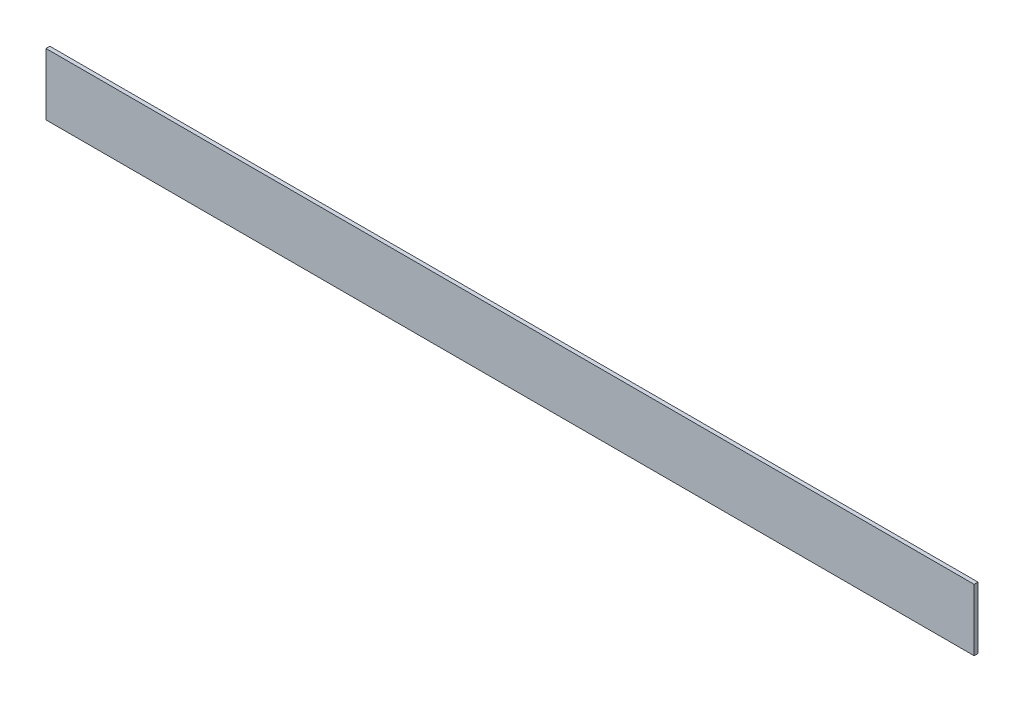
ISO-10303-21;
HEADER;
FILE_DESCRIPTION(('STEP AP214'),'2;1');
FILE_NAME('part.step','',(''),(''),'','','');
FILE_SCHEMA(('AUTOMOTIVE_DESIGN { 1 0 10303 214 1 1 1 1 }'));
ENDSEC;
DATA;
#1=APPLICATION_CONTEXT('core data for automotive mechanical design processes');
#2=APPLICATION_PROTOCOL_DEFINITION('international standard','automotive_design',2000,#1);
#3=PRODUCT_CONTEXT('',#1,'mechanical');
#4=PRODUCT('Part','Part','',(#3));
#5=PRODUCT_RELATED_PRODUCT_CATEGORY('part','',(#4));
#6=PRODUCT_DEFINITION_FORMATION('','',#4);
#7=PRODUCT_DEFINITION_CONTEXT('part definition',#1,'design');
#8=PRODUCT_DEFINITION('design','',#6,#7);
#9=PRODUCT_DEFINITION_SHAPE('','',#8);
#10=(LENGTH_UNIT() NAMED_UNIT(*) SI_UNIT(.MILLI.,.METRE.));
#11=(NAMED_UNIT(*) PLANE_ANGLE_UNIT() SI_UNIT($,.RADIAN.));
#12=(NAMED_UNIT(*) SI_UNIT($,.STERADIAN.) SOLID_ANGLE_UNIT());
#13=UNCERTAINTY_MEASURE_WITH_UNIT(LENGTH_MEASURE(1.E-05),#10,'distance_accuracy_value','');
#14=(GEOMETRIC_REPRESENTATION_CONTEXT(3) GLOBAL_UNCERTAINTY_ASSIGNED_CONTEXT((#13)) GLOBAL_UNIT_ASSIGNED_CONTEXT((#10,
#11,#12)) REPRESENTATION_CONTEXT('',''));
#15=CARTESIAN_POINT('',(0.,0.,0.));
#16=DIRECTION('',(0.,0.,1.));
#17=DIRECTION('',(1.,0.,0.));
#18=AXIS2_PLACEMENT_3D('',#15,#16,#17);
#19=CARTESIAN_POINT('',(0.,0.,3.175));
#20=DIRECTION('',(-1.,0.,0.));
#21=DIRECTION('',(0.,0.,1.));
#22=AXIS2_PLACEMENT_3D('',#19,#20,#21);
#23=PLANE('',#22);
#24=DIRECTION('',(0.,1.,0.));
#25=VECTOR('',#24,1.);
#26=CARTESIAN_POINT('',(0.,0.,0.));
#27=LINE('',#26,#25);
#28=CARTESIAN_POINT('',(0.,-50.8,0.));
#29=VERTEX_POINT('',#28);
#30=CARTESIAN_POINT('',(0.,0.,0.));
#31=VERTEX_POINT('',#30);
#32=EDGE_CURVE('E96',#29,#31,#27,.T.);
#33=ORIENTED_EDGE('',*,*,#32,.T.);
#34=DIRECTION('',(0.,0.,-1.));
#35=VECTOR('',#34,1.);
#36=CARTESIAN_POINT('',(0.,0.,3.175));
#37=LINE('',#36,#35);
#38=CARTESIAN_POINT('',(0.,0.,3.175));
#39=VERTEX_POINT('',#38);
#40=EDGE_CURVE('E11',#39,#31,#37,.T.);
#41=ORIENTED_EDGE('',*,*,#40,.F.);
#42=DIRECTION('',(0.,1.,0.));
#43=VECTOR('',#42,1.);
#44=CARTESIAN_POINT('',(0.,0.,3.175));
#45=LINE('',#44,#43);
#46=CARTESIAN_POINT('',(0.,-50.8,3.175));
#47=VERTEX_POINT('',#46);
#48=EDGE_CURVE('E84',#47,#39,#45,.T.);
#49=ORIENTED_EDGE('',*,*,#48,.F.);
#50=DIRECTION('',(0.,0.,-1.));
#51=VECTOR('',#50,1.);
#52=CARTESIAN_POINT('',(0.,-50.8,3.175));
#53=LINE('',#52,#51);
#54=EDGE_CURVE('E92',#47,#29,#53,.T.);
#55=ORIENTED_EDGE('',*,*,#54,.T.);
#56=EDGE_LOOP('',(#33,#41,#49,#55));
#57=FACE_BOUND('',#56,.T.);
#58=ADVANCED_FACE('F33',(#57),#23,.F.);
#59=CARTESIAN_POINT('',(0.,0.,3.175));
#60=DIRECTION('',(0.,-1.,0.));
#61=DIRECTION('',(1.,0.,0.));
#62=AXIS2_PLACEMENT_3D('',#59,#60,#61);
#63=PLANE('',#62);
#64=DIRECTION('',(-1.,0.,0.));
#65=VECTOR('',#64,1.);
#66=CARTESIAN_POINT('',(0.,0.,0.));
#67=LINE('',#66,#65);
#68=CARTESIAN_POINT('',(-762.,0.,0.));
#69=VERTEX_POINT('',#68);
#70=EDGE_CURVE('E88',#31,#69,#67,.T.);
#71=ORIENTED_EDGE('',*,*,#70,.T.);
#72=DIRECTION('',(0.,0.,-1.));
#73=VECTOR('',#72,1.);
#74=CARTESIAN_POINT('',(-762.,0.,3.175));
#75=LINE('',#74,#73);
#76=CARTESIAN_POINT('',(-762.,0.,3.175));
#77=VERTEX_POINT('',#76);
#78=EDGE_CURVE('E41',#77,#69,#75,.T.);
#79=ORIENTED_EDGE('',*,*,#78,.F.);
#80=DIRECTION('',(-1.,0.,0.));
#81=VECTOR('',#80,1.);
#82=CARTESIAN_POINT('',(0.,0.,3.175));
#83=LINE('',#82,#81);
#84=EDGE_CURVE('E79',#39,#77,#83,.T.);
#85=ORIENTED_EDGE('',*,*,#84,.F.);
#86=ORIENTED_EDGE('',*,*,#40,.T.);
#87=EDGE_LOOP('',(#71,#79,#85,#86));
#88=FACE_BOUND('',#87,.T.);
#89=ADVANCED_FACE('F87',(#88),#63,.F.);
#90=CARTESIAN_POINT('',(-762.,0.,3.175));
#91=DIRECTION('',(1.,0.,0.));
#92=DIRECTION('',(0.,0.,-1.));
#93=AXIS2_PLACEMENT_3D('',#90,#91,#92);
#94=PLANE('',#93);
#95=DIRECTION('',(0.,-1.,0.));
#96=VECTOR('',#95,1.);
#97=CARTESIAN_POINT('',(-762.,0.,0.));
#98=LINE('',#97,#96);
#99=CARTESIAN_POINT('',(-762.,-50.8000000000001,0.));
#100=VERTEX_POINT('',#99);
#101=EDGE_CURVE('E66',#69,#100,#98,.T.);
#102=ORIENTED_EDGE('',*,*,#101,.T.);
#103=DIRECTION('',(0.,0.,-1.));
#104=VECTOR('',#103,1.);
#105=CARTESIAN_POINT('',(-762.,-50.8000000000001,3.175));
#106=LINE('',#105,#104);
#107=CARTESIAN_POINT('',(-762.,-50.8000000000001,3.175));
#108=VERTEX_POINT('',#107);
#109=EDGE_CURVE('E89',#108,#100,#106,.T.);
#110=ORIENTED_EDGE('',*,*,#109,.F.);
#111=DIRECTION('',(0.,-1.,0.));
#112=VECTOR('',#111,1.);
#113=CARTESIAN_POINT('',(-762.,0.,3.175));
#114=LINE('',#113,#112);
#115=EDGE_CURVE('E82',#77,#108,#114,.T.);
#116=ORIENTED_EDGE('',*,*,#115,.F.);
#117=ORIENTED_EDGE('',*,*,#78,.T.);
#118=EDGE_LOOP('',(#102,#110,#116,#117));
#119=FACE_BOUND('',#118,.T.);
#120=ADVANCED_FACE('F90',(#119),#94,.F.);
#121=CARTESIAN_POINT('',(0.,-50.8,3.175));
#122=DIRECTION('',(0.,1.,0.));
#123=DIRECTION('',(-1.,0.,0.));
#124=AXIS2_PLACEMENT_3D('',#121,#122,#123);
#125=PLANE('',#124);
#126=DIRECTION('',(1.,0.,0.));
#127=VECTOR('',#126,1.);
#128=CARTESIAN_POINT('',(0.,-50.8,0.));
#129=LINE('',#128,#127);
#130=EDGE_CURVE('E72',#100,#29,#129,.T.);
#131=ORIENTED_EDGE('',*,*,#130,.T.);
#132=ORIENTED_EDGE('',*,*,#54,.F.);
#133=DIRECTION('',(1.,0.,0.));
#134=VECTOR('',#133,1.);
#135=CARTESIAN_POINT('',(0.,-50.8,3.175));
#136=LINE('',#135,#134);
#137=EDGE_CURVE('E49',#108,#47,#136,.T.);
#138=ORIENTED_EDGE('',*,*,#137,.F.);
#139=ORIENTED_EDGE('',*,*,#109,.T.);
#140=EDGE_LOOP('',(#131,#132,#138,#139));
#141=FACE_BOUND('',#140,.T.);
#142=ADVANCED_FACE('F103',(#141),#125,.F.);
#143=CARTESIAN_POINT('',(0.,0.,3.175));
#144=DIRECTION('',(0.,0.,-1.));
#145=DIRECTION('',(-1.,0.,0.));
#146=AXIS2_PLACEMENT_3D('',#143,#144,#145);
#147=PLANE('',#146);
#148=ORIENTED_EDGE('',*,*,#48,.T.);
#149=ORIENTED_EDGE('',*,*,#84,.T.);
#150=ORIENTED_EDGE('',*,*,#115,.T.);
#151=ORIENTED_EDGE('',*,*,#137,.T.);
#152=EDGE_LOOP('',(#148,#149,#150,#151));
#153=FACE_BOUND('',#152,.T.);
#154=ADVANCED_FACE('F80',(#153),#147,.F.);
#155=CARTESIAN_POINT('',(0.,0.,0.));
#156=DIRECTION('',(0.,0.,-1.));
#157=DIRECTION('',(-1.,0.,0.));
#158=AXIS2_PLACEMENT_3D('',#155,#156,#157);
#159=PLANE('',#158);
#160=ORIENTED_EDGE('',*,*,#32,.F.);
#161=ORIENTED_EDGE('',*,*,#130,.F.);
#162=ORIENTED_EDGE('',*,*,#101,.F.);
#163=ORIENTED_EDGE('',*,*,#70,.F.);
#164=EDGE_LOOP('',(#160,#161,#162,#163));
#165=FACE_BOUND('',#164,.T.);
#166=ADVANCED_FACE('F106',(#165),#159,.T.);
#167=CLOSED_SHELL('',(#58,#89,#120,#142,#154,#166));
#168=MANIFOLD_SOLID_BREP('B2',#167);
#169=ADVANCED_BREP_SHAPE_REPRESENTATION('',(#18,#168),#14);
#170=SHAPE_DEFINITION_REPRESENTATION(#9,#169);
ENDSEC;
END-ISO-10303-21;
